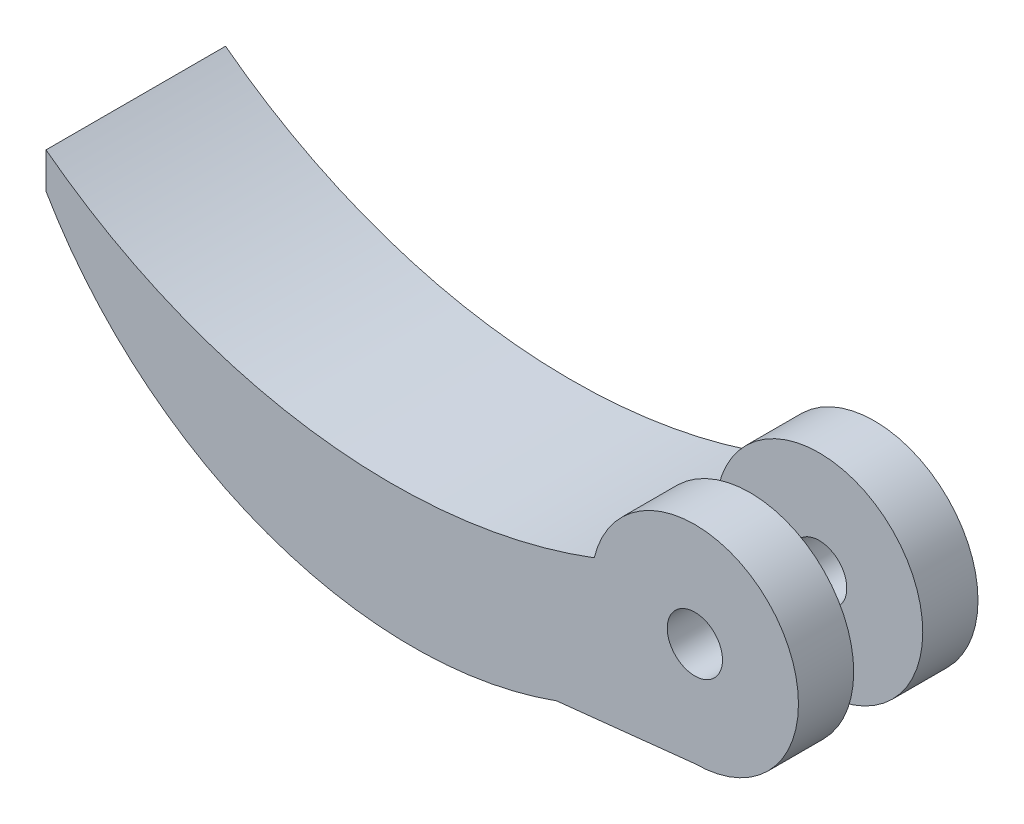
ISO-10303-21;
HEADER;
FILE_DESCRIPTION(('STEP AP214'),'2;1');
FILE_NAME('part.step','',(''),(''),'','','');
FILE_SCHEMA(('AUTOMOTIVE_DESIGN { 1 0 10303 214 1 1 1 1 }'));
ENDSEC;
DATA;
#1=APPLICATION_CONTEXT('core data for automotive mechanical design processes');
#2=APPLICATION_PROTOCOL_DEFINITION('international standard','automotive_design',2000,#1);
#3=PRODUCT_CONTEXT('',#1,'mechanical');
#4=PRODUCT('Part','Part','',(#3));
#5=PRODUCT_RELATED_PRODUCT_CATEGORY('part','',(#4));
#6=PRODUCT_DEFINITION_FORMATION('','',#4);
#7=PRODUCT_DEFINITION_CONTEXT('part definition',#1,'design');
#8=PRODUCT_DEFINITION('design','',#6,#7);
#9=PRODUCT_DEFINITION_SHAPE('','',#8);
#10=(LENGTH_UNIT() NAMED_UNIT(*) SI_UNIT(.MILLI.,.METRE.));
#11=(NAMED_UNIT(*) PLANE_ANGLE_UNIT() SI_UNIT($,.RADIAN.));
#12=(NAMED_UNIT(*) SI_UNIT($,.STERADIAN.) SOLID_ANGLE_UNIT());
#13=UNCERTAINTY_MEASURE_WITH_UNIT(LENGTH_MEASURE(1.E-05),#10,'distance_accuracy_value','');
#14=(GEOMETRIC_REPRESENTATION_CONTEXT(3) GLOBAL_UNCERTAINTY_ASSIGNED_CONTEXT((#13)) GLOBAL_UNIT_ASSIGNED_CONTEXT((#10,
#11,#12)) REPRESENTATION_CONTEXT('',''));
#15=CARTESIAN_POINT('',(0.,0.,0.));
#16=DIRECTION('',(0.,0.,1.));
#17=DIRECTION('',(1.,0.,0.));
#18=AXIS2_PLACEMENT_3D('',#15,#16,#17);
#19=CARTESIAN_POINT('',(0.,0.,-9.));
#20=DIRECTION('',(0.,0.,1.));
#21=DIRECTION('',(1.,0.,0.));
#22=AXIS2_PLACEMENT_3D('',#19,#20,#21);
#23=CYLINDRICAL_SURFACE('',#22,7.5);
#24=DIRECTION('',(0.,0.,1.));
#25=VECTOR('',#24,1.);
#26=CARTESIAN_POINT('',(0.,-7.5,-9.));
#27=LINE('',#26,#25);
#28=CARTESIAN_POINT('',(0.,-7.5,-5.));
#29=VERTEX_POINT('',#28);
#30=CARTESIAN_POINT('',(0.,-7.5,0.));
#31=VERTEX_POINT('',#30);
#32=EDGE_CURVE('E58',#29,#31,#27,.T.);
#33=ORIENTED_EDGE('',*,*,#32,.F.);
#34=CARTESIAN_POINT('',(0.,0.,-5.));
#35=DIRECTION('',(0.,0.,-1.));
#36=DIRECTION('',(-1.,0.,0.));
#37=AXIS2_PLACEMENT_3D('',#34,#35,#36);
#38=CIRCLE('',#37,7.5);
#39=CARTESIAN_POINT('',(-7.28877143549675,1.76743060997776,-5.));
#40=VERTEX_POINT('',#39);
#41=EDGE_CURVE('E53',#29,#40,#38,.T.);
#42=ORIENTED_EDGE('',*,*,#41,.T.);
#43=DIRECTION('',(0.,0.,1.));
#44=VECTOR('',#43,1.);
#45=CARTESIAN_POINT('',(-7.28877143549675,1.76743060997776,-9.));
#46=LINE('',#45,#44);
#47=CARTESIAN_POINT('',(-7.28877143549675,1.76743060997776,0.));
#48=VERTEX_POINT('',#47);
#49=EDGE_CURVE('E114',#40,#48,#46,.T.);
#50=ORIENTED_EDGE('',*,*,#49,.T.);
#51=CARTESIAN_POINT('',(0.,0.,0.));
#52=DIRECTION('',(0.,0.,1.));
#53=DIRECTION('',(1.,0.,0.));
#54=AXIS2_PLACEMENT_3D('',#51,#52,#53);
#55=CIRCLE('',#54,7.5);
#56=EDGE_CURVE('E162',#48,#31,#55,.T.);
#57=ORIENTED_EDGE('',*,*,#56,.T.);
#58=EDGE_LOOP('',(#33,#42,#50,#57));
#59=FACE_BOUND('',#58,.T.);
#60=ADVANCED_FACE('F38',(#59),#23,.F.);
#61=CARTESIAN_POINT('',(0.,0.,4.));
#62=DIRECTION('',(0.,0.,1.));
#63=DIRECTION('',(1.,0.,0.));
#64=AXIS2_PLACEMENT_3D('',#61,#62,#63);
#65=PLANE('',#64);
#66=CARTESIAN_POINT('',(0.,0.,4.));
#67=DIRECTION('',(0.,0.,1.));
#68=DIRECTION('',(1.,0.,0.));
#69=AXIS2_PLACEMENT_3D('',#66,#67,#68);
#70=CIRCLE('',#69,7.5);
#71=CARTESIAN_POINT('',(0.,-7.5,4.));
#72=VERTEX_POINT('',#71);
#73=CARTESIAN_POINT('',(-7.28877143549675,1.76743060997776,4.));
#74=VERTEX_POINT('',#73);
#75=EDGE_CURVE('E159',#72,#74,#70,.T.);
#76=ORIENTED_EDGE('',*,*,#75,.T.);
#77=CARTESIAN_POINT('',(-21.9545188477538,40.5061940782808,4.));
#78=DIRECTION('',(0.,0.,-1.));
#79=DIRECTION('',(-1.,0.,0.));
#80=AXIS2_PLACEMENT_3D('',#77,#78,#79);
#81=CIRCLE('',#80,41.4219258631616);
#82=CARTESIAN_POINT('',(-46.9818458061031,7.49999999999999,4.));
#83=VERTEX_POINT('',#82);
#84=EDGE_CURVE('E142',#74,#83,#81,.T.);
#85=ORIENTED_EDGE('',*,*,#84,.T.);
#86=DIRECTION('',(0.,-1.,0.));
#87=VECTOR('',#86,1.);
#88=CARTESIAN_POINT('',(-46.9818458061031,4.90393409006629,4.));
#89=LINE('',#88,#87);
#90=CARTESIAN_POINT('',(-46.9818458061031,4.90393409006629,4.));
#91=VERTEX_POINT('',#90);
#92=EDGE_CURVE('E137',#83,#91,#89,.T.);
#93=ORIENTED_EDGE('',*,*,#92,.T.);
#94=CARTESIAN_POINT('',(-20.4372430160604,20.2856612233375,4.));
#95=DIRECTION('',(0.,0.,1.));
#96=DIRECTION('',(-1.,0.,0.));
#97=AXIS2_PLACEMENT_3D('',#94,#95,#96);
#98=CIRCLE('',#97,30.679202513813);
#99=CARTESIAN_POINT('',(-10.009282788127,-8.56691426600475,4.));
#100=VERTEX_POINT('',#99);
#101=EDGE_CURVE('E123',#91,#100,#98,.T.);
#102=ORIENTED_EDGE('',*,*,#101,.T.);
#103=DIRECTION('',(0.994366978123419,0.105992041294143,0.));
#104=VECTOR('',#103,1.);
#105=CARTESIAN_POINT('',(-10.009282788127,-8.56691426600475,4.));
#106=LINE('',#105,#104);
#107=EDGE_CURVE('E127',#100,#72,#106,.T.);
#108=ORIENTED_EDGE('',*,*,#107,.T.);
#109=EDGE_LOOP('',(#76,#85,#93,#102,#108));
#110=FACE_BOUND('',#109,.T.);
#111=CARTESIAN_POINT('',(0.,0.,4.));
#112=DIRECTION('',(0.,0.,1.));
#113=DIRECTION('',(1.,0.,0.));
#114=AXIS2_PLACEMENT_3D('',#111,#112,#113);
#115=CIRCLE('',#114,2.);
#116=CARTESIAN_POINT('',(2.,0.,4.));
#117=VERTEX_POINT('',#116);
#118=EDGE_CURVE('E153',#117,#117,#115,.T.);
#119=ORIENTED_EDGE('',*,*,#118,.F.);
#120=EDGE_LOOP('',(#119));
#121=FACE_BOUND('',#120,.T.);
#122=ADVANCED_FACE('F176',(#110,#121),#65,.T.);
#123=CARTESIAN_POINT('',(0.,0.,0.));
#124=DIRECTION('',(0.,0.,1.));
#125=DIRECTION('',(1.,0.,0.));
#126=AXIS2_PLACEMENT_3D('',#123,#124,#125);
#127=PLANE('',#126);
#128=ORIENTED_EDGE('',*,*,#56,.F.);
#129=EDGE_CURVE('E156',#31,#48,#55,.T.);
#130=ORIENTED_EDGE('',*,*,#129,.F.);
#131=EDGE_LOOP('',(#128,#130));
#132=FACE_BOUND('',#131,.T.);
#133=CARTESIAN_POINT('',(0.,0.,0.));
#134=DIRECTION('',(0.,0.,1.));
#135=DIRECTION('',(1.,0.,0.));
#136=AXIS2_PLACEMENT_3D('',#133,#134,#135);
#137=CIRCLE('',#136,2.);
#138=CARTESIAN_POINT('',(2.,0.,0.));
#139=VERTEX_POINT('',#138);
#140=EDGE_CURVE('E149',#139,#139,#137,.T.);
#141=ORIENTED_EDGE('',*,*,#140,.T.);
#142=EDGE_LOOP('',(#141));
#143=FACE_BOUND('',#142,.T.);
#144=ADVANCED_FACE('F173',(#132,#143),#127,.F.);
#145=CARTESIAN_POINT('',(0.,0.,4.));
#146=DIRECTION('',(0.,0.,-1.));
#147=DIRECTION('',(-1.,0.,0.));
#148=AXIS2_PLACEMENT_3D('',#145,#146,#147);
#149=CYLINDRICAL_SURFACE('',#148,7.5);
#150=ORIENTED_EDGE('',*,*,#129,.T.);
#151=DIRECTION('',(0.,0.,1.));
#152=VECTOR('',#151,1.);
#153=CARTESIAN_POINT('',(-7.28877143549678,1.76743060997776,1.99999999999999));
#154=LINE('',#153,#152);
#155=EDGE_CURVE('E11',#48,#74,#154,.T.);
#156=ORIENTED_EDGE('',*,*,#155,.T.);
#157=ORIENTED_EDGE('',*,*,#75,.F.);
#158=DIRECTION('',(0.,0.,-1.));
#159=VECTOR('',#158,1.);
#160=CARTESIAN_POINT('',(0.,-7.5,4.));
#161=LINE('',#160,#159);
#162=EDGE_CURVE('E46',#72,#31,#161,.T.);
#163=ORIENTED_EDGE('',*,*,#162,.T.);
#164=EDGE_LOOP('',(#150,#156,#157,#163));
#165=FACE_BOUND('',#164,.T.);
#166=ADVANCED_FACE('F40',(#165),#149,.T.);
#167=CARTESIAN_POINT('',(0.,0.,4.));
#168=DIRECTION('',(0.,0.,-1.));
#169=DIRECTION('',(-1.,0.,0.));
#170=AXIS2_PLACEMENT_3D('',#167,#168,#169);
#171=CYLINDRICAL_SURFACE('',#170,2.);
#172=ORIENTED_EDGE('',*,*,#118,.T.);
#173=EDGE_LOOP('',(#172));
#174=FACE_BOUND('',#173,.T.);
#175=ORIENTED_EDGE('',*,*,#140,.F.);
#176=EDGE_LOOP('',(#175));
#177=FACE_BOUND('',#176,.T.);
#178=ADVANCED_FACE('F192',(#174,#177),#171,.F.);
#179=CARTESIAN_POINT('',(-20.4372430160604,20.2856612233375,-9.));
#180=DIRECTION('',(0.,0.,1.));
#181=DIRECTION('',(1.,0.,0.));
#182=AXIS2_PLACEMENT_3D('',#179,#180,#181);
#183=CYLINDRICAL_SURFACE('',#182,30.679202513813);
#184=ORIENTED_EDGE('',*,*,#101,.F.);
#185=DIRECTION('',(0.,0.,1.));
#186=VECTOR('',#185,1.);
#187=CARTESIAN_POINT('',(-46.9818458061031,4.90393409006629,-9.));
#188=LINE('',#187,#186);
#189=CARTESIAN_POINT('',(-46.9818458061031,4.90393409006629,-9.));
#190=VERTEX_POINT('',#189);
#191=EDGE_CURVE('E147',#190,#91,#188,.T.);
#192=ORIENTED_EDGE('',*,*,#191,.F.);
#193=CARTESIAN_POINT('',(-20.4372430160604,20.2856612233375,-9.));
#194=DIRECTION('',(0.,0.,1.));
#195=DIRECTION('',(-1.,0.,0.));
#196=AXIS2_PLACEMENT_3D('',#193,#194,#195);
#197=CIRCLE('',#196,30.679202513813);
#198=CARTESIAN_POINT('',(-10.009282788127,-8.56691426600475,-9.));
#199=VERTEX_POINT('',#198);
#200=EDGE_CURVE('E134',#190,#199,#197,.T.);
#201=ORIENTED_EDGE('',*,*,#200,.T.);
#202=DIRECTION('',(0.,0.,1.));
#203=VECTOR('',#202,1.);
#204=CARTESIAN_POINT('',(-10.009282788127,-8.56691426600475,-9.));
#205=LINE('',#204,#203);
#206=EDGE_CURVE('E139',#199,#100,#205,.T.);
#207=ORIENTED_EDGE('',*,*,#206,.T.);
#208=EDGE_LOOP('',(#184,#192,#201,#207));
#209=FACE_BOUND('',#208,.T.);
#210=ADVANCED_FACE('F182',(#209),#183,.T.);
#211=CARTESIAN_POINT('',(-46.9818458061031,4.90393409006629,-9.));
#212=DIRECTION('',(-1.,0.,0.));
#213=DIRECTION('',(0.,0.,1.));
#214=AXIS2_PLACEMENT_3D('',#211,#212,#213);
#215=PLANE('',#214);
#216=ORIENTED_EDGE('',*,*,#92,.F.);
#217=DIRECTION('',(0.,0.,1.));
#218=VECTOR('',#217,1.);
#219=CARTESIAN_POINT('',(-46.9818458061031,7.49999999999999,-9.));
#220=LINE('',#219,#218);
#221=CARTESIAN_POINT('',(-46.9818458061031,7.49999999999999,-9.));
#222=VERTEX_POINT('',#221);
#223=EDGE_CURVE('E118',#222,#83,#220,.T.);
#224=ORIENTED_EDGE('',*,*,#223,.F.);
#225=DIRECTION('',(0.,-1.,0.));
#226=VECTOR('',#225,1.);
#227=CARTESIAN_POINT('',(-46.9818458061031,4.90393409006629,-9.));
#228=LINE('',#227,#226);
#229=EDGE_CURVE('E106',#222,#190,#228,.T.);
#230=ORIENTED_EDGE('',*,*,#229,.T.);
#231=ORIENTED_EDGE('',*,*,#191,.T.);
#232=EDGE_LOOP('',(#216,#224,#230,#231));
#233=FACE_BOUND('',#232,.T.);
#234=ADVANCED_FACE('F184',(#233),#215,.T.);
#235=CARTESIAN_POINT('',(-21.9545188477538,40.5061940782808,-9.));
#236=DIRECTION('',(0.,0.,1.));
#237=DIRECTION('',(1.,0.,0.));
#238=AXIS2_PLACEMENT_3D('',#235,#236,#237);
#239=CYLINDRICAL_SURFACE('',#238,41.4219258631616);
#240=ORIENTED_EDGE('',*,*,#84,.F.);
#241=ORIENTED_EDGE('',*,*,#155,.F.);
#242=ORIENTED_EDGE('',*,*,#49,.F.);
#243=CARTESIAN_POINT('',(-7.28877143549677,1.76743060997776,-9.));
#244=VERTEX_POINT('',#243);
#245=EDGE_CURVE('E111',#244,#40,#46,.T.);
#246=ORIENTED_EDGE('',*,*,#245,.F.);
#247=CARTESIAN_POINT('',(-21.9545188477538,40.5061940782808,-9.));
#248=DIRECTION('',(0.,0.,-1.));
#249=DIRECTION('',(-1.,0.,0.));
#250=AXIS2_PLACEMENT_3D('',#247,#248,#249);
#251=CIRCLE('',#250,41.4219258631616);
#252=EDGE_CURVE('E97',#244,#222,#251,.T.);
#253=ORIENTED_EDGE('',*,*,#252,.T.);
#254=ORIENTED_EDGE('',*,*,#223,.T.);
#255=EDGE_LOOP('',(#240,#241,#242,#246,#253,#254));
#256=FACE_BOUND('',#255,.T.);
#257=ADVANCED_FACE('F112',(#256),#239,.F.);
#258=CARTESIAN_POINT('',(-10.009282788127,-8.56691426600475,-9.));
#259=DIRECTION('',(0.105992041294143,-0.994366978123419,0.));
#260=DIRECTION('',(0.994366978123419,0.105992041294143,0.));
#261=AXIS2_PLACEMENT_3D('',#258,#259,#260);
#262=PLANE('',#261);
#263=ORIENTED_EDGE('',*,*,#107,.F.);
#264=ORIENTED_EDGE('',*,*,#206,.F.);
#265=DIRECTION('',(0.994366978123419,0.105992041294143,0.));
#266=VECTOR('',#265,1.);
#267=CARTESIAN_POINT('',(-10.009282788127,-8.56691426600475,-9.));
#268=LINE('',#267,#266);
#269=CARTESIAN_POINT('',(0.,-7.5,-9.));
#270=VERTEX_POINT('',#269);
#271=EDGE_CURVE('E108',#199,#270,#268,.T.);
#272=ORIENTED_EDGE('',*,*,#271,.T.);
#273=EDGE_CURVE('E122',#270,#29,#27,.T.);
#274=ORIENTED_EDGE('',*,*,#273,.T.);
#275=ORIENTED_EDGE('',*,*,#32,.T.);
#276=ORIENTED_EDGE('',*,*,#162,.F.);
#277=EDGE_LOOP('',(#263,#264,#272,#274,#275,#276));
#278=FACE_BOUND('',#277,.T.);
#279=ADVANCED_FACE('F180',(#278),#262,.T.);
#280=CARTESIAN_POINT('',(-20.4372430160604,20.2856612233375,-9.));
#281=DIRECTION('',(0.,0.,-1.));
#282=DIRECTION('',(-1.,0.,0.));
#283=AXIS2_PLACEMENT_3D('',#280,#281,#282);
#284=PLANE('',#283);
#285=ORIENTED_EDGE('',*,*,#200,.F.);
#286=ORIENTED_EDGE('',*,*,#229,.F.);
#287=ORIENTED_EDGE('',*,*,#252,.F.);
#288=CARTESIAN_POINT('',(0.,0.,-9.));
#289=DIRECTION('',(0.,0.,-1.));
#290=DIRECTION('',(-1.,0.,0.));
#291=AXIS2_PLACEMENT_3D('',#288,#289,#290);
#292=CIRCLE('',#291,7.5);
#293=EDGE_CURVE('E104',#244,#270,#292,.T.);
#294=ORIENTED_EDGE('',*,*,#293,.T.);
#295=ORIENTED_EDGE('',*,*,#271,.F.);
#296=EDGE_LOOP('',(#285,#286,#287,#294,#295));
#297=FACE_BOUND('',#296,.T.);
#298=CARTESIAN_POINT('',(0.,0.,-9.));
#299=DIRECTION('',(0.,0.,-1.));
#300=DIRECTION('',(-1.,0.,0.));
#301=AXIS2_PLACEMENT_3D('',#298,#299,#300);
#302=CIRCLE('',#301,2.);
#303=CARTESIAN_POINT('',(-2.,0.,-9.));
#304=VERTEX_POINT('',#303);
#305=EDGE_CURVE('E302',#304,#304,#302,.T.);
#306=ORIENTED_EDGE('',*,*,#305,.F.);
#307=EDGE_LOOP('',(#306));
#308=FACE_BOUND('',#307,.T.);
#309=ADVANCED_FACE('F100',(#297,#308),#284,.T.);
#310=CARTESIAN_POINT('',(0.,0.,-5.));
#311=DIRECTION('',(0.,0.,-1.));
#312=DIRECTION('',(-1.,0.,0.));
#313=AXIS2_PLACEMENT_3D('',#310,#311,#312);
#314=PLANE('',#313);
#315=EDGE_CURVE('E124',#40,#29,#38,.T.);
#316=ORIENTED_EDGE('',*,*,#315,.F.);
#317=ORIENTED_EDGE('',*,*,#41,.F.);
#318=EDGE_LOOP('',(#316,#317));
#319=FACE_BOUND('',#318,.T.);
#320=CARTESIAN_POINT('',(0.,0.,-5.));
#321=DIRECTION('',(0.,0.,-1.));
#322=DIRECTION('',(-1.,0.,0.));
#323=AXIS2_PLACEMENT_3D('',#320,#321,#322);
#324=CIRCLE('',#323,2.);
#325=CARTESIAN_POINT('',(-2.,0.,-5.));
#326=VERTEX_POINT('',#325);
#327=EDGE_CURVE('E131',#326,#326,#324,.T.);
#328=ORIENTED_EDGE('',*,*,#327,.T.);
#329=EDGE_LOOP('',(#328));
#330=FACE_BOUND('',#329,.T.);
#331=ADVANCED_FACE('F246',(#319,#330),#314,.F.);
#332=CARTESIAN_POINT('',(0.,0.,-9.));
#333=DIRECTION('',(0.,0.,1.));
#334=DIRECTION('',(1.,0.,0.));
#335=AXIS2_PLACEMENT_3D('',#332,#333,#334);
#336=CYLINDRICAL_SURFACE('',#335,7.5);
#337=ORIENTED_EDGE('',*,*,#245,.T.);
#338=ORIENTED_EDGE('',*,*,#315,.T.);
#339=ORIENTED_EDGE('',*,*,#273,.F.);
#340=ORIENTED_EDGE('',*,*,#293,.F.);
#341=EDGE_LOOP('',(#337,#338,#339,#340));
#342=FACE_BOUND('',#341,.T.);
#343=ADVANCED_FACE('F121',(#342),#336,.T.);
#344=CARTESIAN_POINT('',(0.,0.,-9.));
#345=DIRECTION('',(0.,0.,1.));
#346=DIRECTION('',(1.,0.,0.));
#347=AXIS2_PLACEMENT_3D('',#344,#345,#346);
#348=CYLINDRICAL_SURFACE('',#347,2.);
#349=ORIENTED_EDGE('',*,*,#305,.T.);
#350=EDGE_LOOP('',(#349));
#351=FACE_BOUND('',#350,.T.);
#352=ORIENTED_EDGE('',*,*,#327,.F.);
#353=EDGE_LOOP('',(#352));
#354=FACE_BOUND('',#353,.T.);
#355=ADVANCED_FACE('F264',(#351,#354),#348,.F.);
#356=CLOSED_SHELL('',(#60,#122,#144,#166,#178,#210,#234,#257,#279,#309,#331,#343,#355));
#357=MANIFOLD_SOLID_BREP('B2',#356);
#358=ADVANCED_BREP_SHAPE_REPRESENTATION('',(#18,#357),#14);
#359=SHAPE_DEFINITION_REPRESENTATION(#9,#358);
ENDSEC;
END-ISO-10303-21;
